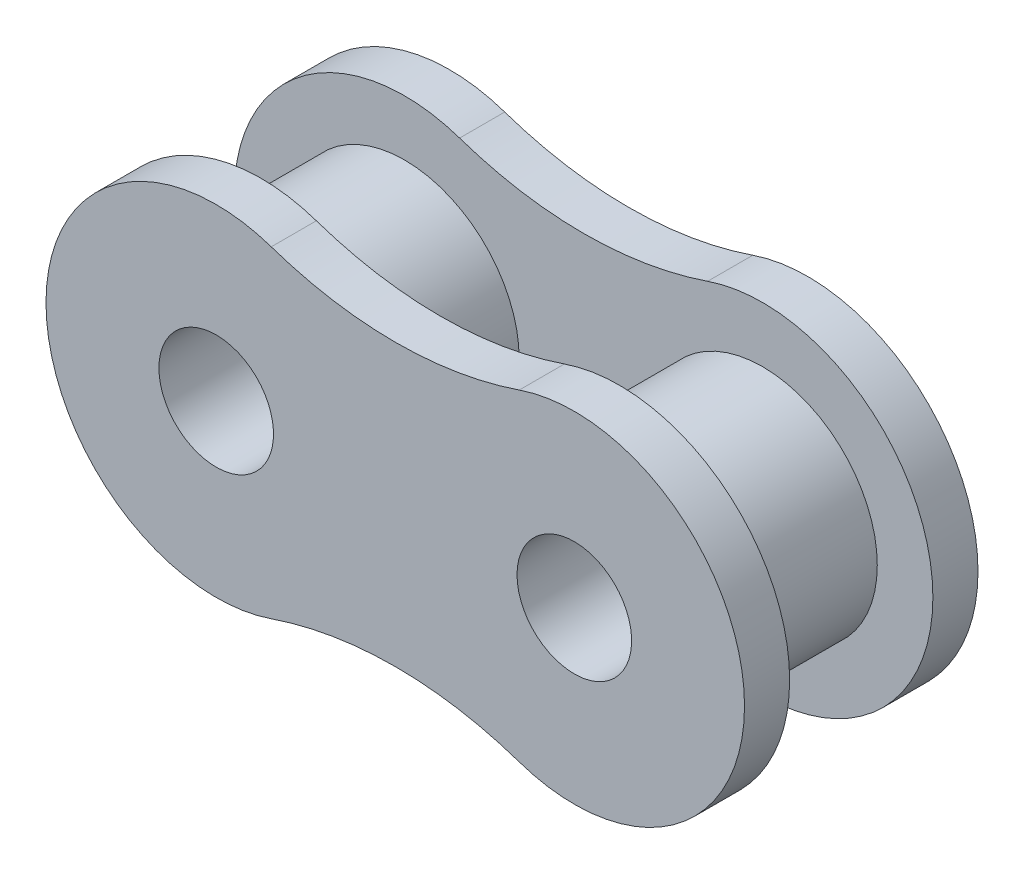
ISO-10303-21;
HEADER;
FILE_DESCRIPTION(('STEP AP214'),'2;1');
FILE_NAME('part.step','',(''),(''),'','','');
FILE_SCHEMA(('AUTOMOTIVE_DESIGN { 1 0 10303 214 1 1 1 1 }'));
ENDSEC;
DATA;
#1=APPLICATION_CONTEXT('core data for automotive mechanical design processes');
#2=APPLICATION_PROTOCOL_DEFINITION('international standard','automotive_design',2000,#1);
#3=PRODUCT_CONTEXT('',#1,'mechanical');
#4=PRODUCT('Part','Part','',(#3));
#5=PRODUCT_RELATED_PRODUCT_CATEGORY('part','',(#4));
#6=PRODUCT_DEFINITION_FORMATION('','',#4);
#7=PRODUCT_DEFINITION_CONTEXT('part definition',#1,'design');
#8=PRODUCT_DEFINITION('design','',#6,#7);
#9=PRODUCT_DEFINITION_SHAPE('','',#8);
#10=(LENGTH_UNIT() NAMED_UNIT(*) SI_UNIT(.MILLI.,.METRE.));
#11=(NAMED_UNIT(*) PLANE_ANGLE_UNIT() SI_UNIT($,.RADIAN.));
#12=(NAMED_UNIT(*) SI_UNIT($,.STERADIAN.) SOLID_ANGLE_UNIT());
#13=UNCERTAINTY_MEASURE_WITH_UNIT(LENGTH_MEASURE(1.E-05),#10,'distance_accuracy_value','');
#14=(GEOMETRIC_REPRESENTATION_CONTEXT(3) GLOBAL_UNCERTAINTY_ASSIGNED_CONTEXT((#13)) GLOBAL_UNIT_ASSIGNED_CONTEXT((#10,
#11,#12)) REPRESENTATION_CONTEXT('',''));
#15=CARTESIAN_POINT('',(0.,0.,0.));
#16=DIRECTION('',(0.,0.,1.));
#17=DIRECTION('',(1.,0.,0.));
#18=AXIS2_PLACEMENT_3D('',#15,#16,#17);
#19=CARTESIAN_POINT('',(11.90625,11.6130650427654,2.));
#20=DIRECTION('',(0.,0.,1.));
#21=DIRECTION('',(1.,0.,0.));
#22=AXIS2_PLACEMENT_3D('',#19,#20,#21);
#23=PLANE('',#22);
#24=CARTESIAN_POINT('',(0.,0.,2.));
#25=DIRECTION('',(0.,0.,-1.));
#26=DIRECTION('',(-1.,0.,0.));
#27=AXIS2_PLACEMENT_3D('',#24,#25,#26);
#28=CIRCLE('',#27,5.08);
#29=CARTESIAN_POINT('',(-5.08,0.,2.));
#30=VERTEX_POINT('',#29);
#31=EDGE_CURVE('E91',#30,#30,#28,.F.);
#32=ORIENTED_EDGE('',*,*,#31,.F.);
#33=EDGE_LOOP('',(#32));
#34=FACE_BOUND('',#33,.T.);
#35=CARTESIAN_POINT('',(7.9375,-23.2261300855308,2.));
#36=DIRECTION('',(0.,0.,-1.));
#37=DIRECTION('',(-1.,0.,0.));
#38=AXIS2_PLACEMENT_3D('',#35,#36,#37);
#39=CIRCLE('',#38,17.);
#40=CARTESIAN_POINT('',(2.43994448971277,-7.13958653474557,2.));
#41=VERTEX_POINT('',#40);
#42=CARTESIAN_POINT('',(13.4350555102872,-7.13958653474557,2.));
#43=VERTEX_POINT('',#42);
#44=EDGE_CURVE('E82',#41,#43,#39,.T.);
#45=ORIENTED_EDGE('',*,*,#44,.T.);
#46=CARTESIAN_POINT('',(15.875,0.,2.));
#47=DIRECTION('',(0.,0.,-1.));
#48=DIRECTION('',(-1.,0.,0.));
#49=AXIS2_PLACEMENT_3D('',#46,#47,#48);
#50=CIRCLE('',#49,7.545);
#51=CARTESIAN_POINT('',(13.4350555102872,7.13958653474557,2.));
#52=VERTEX_POINT('',#51);
#53=EDGE_CURVE('E98',#52,#43,#50,.T.);
#54=ORIENTED_EDGE('',*,*,#53,.F.);
#55=CARTESIAN_POINT('',(7.9375,23.2261300855308,2.));
#56=DIRECTION('',(0.,0.,-1.));
#57=DIRECTION('',(-1.,0.,0.));
#58=AXIS2_PLACEMENT_3D('',#55,#56,#57);
#59=CIRCLE('',#58,17.);
#60=CARTESIAN_POINT('',(2.43994448971277,7.13958653474557,2.));
#61=VERTEX_POINT('',#60);
#62=EDGE_CURVE('E85',#52,#61,#59,.T.);
#63=ORIENTED_EDGE('',*,*,#62,.T.);
#64=CARTESIAN_POINT('',(0.,0.,2.));
#65=DIRECTION('',(0.,0.,-1.));
#66=DIRECTION('',(-1.,0.,0.));
#67=AXIS2_PLACEMENT_3D('',#64,#65,#66);
#68=CIRCLE('',#67,7.545);
#69=EDGE_CURVE('E79',#41,#61,#68,.T.);
#70=ORIENTED_EDGE('',*,*,#69,.F.);
#71=EDGE_LOOP('',(#45,#54,#63,#70));
#72=FACE_BOUND('',#71,.T.);
#73=CARTESIAN_POINT('',(15.875,0.,2.));
#74=DIRECTION('',(0.,0.,-1.));
#75=DIRECTION('',(-1.,0.,0.));
#76=AXIS2_PLACEMENT_3D('',#73,#74,#75);
#77=CIRCLE('',#76,5.08);
#78=CARTESIAN_POINT('',(10.795,0.,2.));
#79=VERTEX_POINT('',#78);
#80=EDGE_CURVE('E19',#79,#79,#77,.F.);
#81=ORIENTED_EDGE('',*,*,#80,.F.);
#82=EDGE_LOOP('',(#81));
#83=FACE_BOUND('',#82,.T.);
#84=ADVANCED_FACE('F16',(#34,#72,#83),#23,.T.);
#85=CARTESIAN_POINT('',(15.875,0.,5.175));
#86=DIRECTION('',(0.,0.,-1.));
#87=DIRECTION('',(-1.,0.,0.));
#88=AXIS2_PLACEMENT_3D('',#85,#86,#87);
#89=CYLINDRICAL_SURFACE('',#88,5.08);
#90=ORIENTED_EDGE('',*,*,#80,.T.);
#91=EDGE_LOOP('',(#90));
#92=FACE_BOUND('',#91,.T.);
#93=CARTESIAN_POINT('',(15.875,0.,8.35));
#94=DIRECTION('',(0.,0.,-1.));
#95=DIRECTION('',(-1.,0.,0.));
#96=AXIS2_PLACEMENT_3D('',#93,#94,#95);
#97=CIRCLE('',#96,5.08);
#98=CARTESIAN_POINT('',(10.795,0.,8.35));
#99=VERTEX_POINT('',#98);
#100=EDGE_CURVE('E151',#99,#99,#97,.F.);
#101=ORIENTED_EDGE('',*,*,#100,.F.);
#102=EDGE_LOOP('',(#101));
#103=FACE_BOUND('',#102,.T.);
#104=ADVANCED_FACE('F163',(#92,#103),#89,.T.);
#105=CARTESIAN_POINT('',(0.,0.,5.175));
#106=DIRECTION('',(0.,0.,-1.));
#107=DIRECTION('',(-1.,0.,0.));
#108=AXIS2_PLACEMENT_3D('',#105,#106,#107);
#109=CYLINDRICAL_SURFACE('',#108,5.08);
#110=ORIENTED_EDGE('',*,*,#31,.T.);
#111=EDGE_LOOP('',(#110));
#112=FACE_BOUND('',#111,.T.);
#113=CARTESIAN_POINT('',(0.,0.,8.35));
#114=DIRECTION('',(0.,0.,-1.));
#115=DIRECTION('',(-1.,0.,0.));
#116=AXIS2_PLACEMENT_3D('',#113,#114,#115);
#117=CIRCLE('',#116,5.08);
#118=CARTESIAN_POINT('',(-5.08,0.,8.35));
#119=VERTEX_POINT('',#118);
#120=EDGE_CURVE('E148',#119,#119,#117,.F.);
#121=ORIENTED_EDGE('',*,*,#120,.F.);
#122=EDGE_LOOP('',(#121));
#123=FACE_BOUND('',#122,.T.);
#124=ADVANCED_FACE('F171',(#112,#123),#109,.T.);
#125=CARTESIAN_POINT('',(0.,0.,2.));
#126=DIRECTION('',(0.,0.,-1.));
#127=DIRECTION('',(-1.,0.,0.));
#128=AXIS2_PLACEMENT_3D('',#125,#126,#127);
#129=CYLINDRICAL_SURFACE('',#128,7.545);
#130=CARTESIAN_POINT('',(0.,0.,0.));
#131=DIRECTION('',(0.,0.,-1.));
#132=DIRECTION('',(-1.,0.,0.));
#133=AXIS2_PLACEMENT_3D('',#130,#131,#132);
#134=CIRCLE('',#133,7.545);
#135=CARTESIAN_POINT('',(2.43994448971277,7.13958653474557,0.));
#136=VERTEX_POINT('',#135);
#137=CARTESIAN_POINT('',(2.43994448971277,-7.13958653474557,0.));
#138=VERTEX_POINT('',#137);
#139=EDGE_CURVE('E102',#136,#138,#134,.F.);
#140=ORIENTED_EDGE('',*,*,#139,.T.);
#141=DIRECTION('',(0.,0.,-1.));
#142=VECTOR('',#141,1.);
#143=CARTESIAN_POINT('',(2.43994448971277,-7.13958653474557,2.));
#144=LINE('',#143,#142);
#145=EDGE_CURVE('E90',#138,#41,#144,.F.);
#146=ORIENTED_EDGE('',*,*,#145,.T.);
#147=ORIENTED_EDGE('',*,*,#69,.T.);
#148=DIRECTION('',(0.,0.,-1.));
#149=VECTOR('',#148,1.);
#150=CARTESIAN_POINT('',(2.43994448971277,7.13958653474557,2.));
#151=LINE('',#150,#149);
#152=EDGE_CURVE('E154',#61,#136,#151,.T.);
#153=ORIENTED_EDGE('',*,*,#152,.T.);
#154=EDGE_LOOP('',(#140,#146,#147,#153));
#155=FACE_BOUND('',#154,.T.);
#156=ADVANCED_FACE('F101',(#155),#129,.T.);
#157=CARTESIAN_POINT('',(7.9375,-23.2261300855308,2.));
#158=DIRECTION('',(0.,0.,-1.));
#159=DIRECTION('',(-1.,0.,0.));
#160=AXIS2_PLACEMENT_3D('',#157,#158,#159);
#161=CYLINDRICAL_SURFACE('',#160,17.);
#162=DIRECTION('',(0.,0.,-1.));
#163=VECTOR('',#162,1.);
#164=CARTESIAN_POINT('',(13.4350555102872,-7.13958653474557,2.));
#165=LINE('',#164,#163);
#166=CARTESIAN_POINT('',(13.4350555102872,-7.13958653474557,0.));
#167=VERTEX_POINT('',#166);
#168=EDGE_CURVE('E97',#43,#167,#165,.T.);
#169=ORIENTED_EDGE('',*,*,#168,.F.);
#170=ORIENTED_EDGE('',*,*,#44,.F.);
#171=ORIENTED_EDGE('',*,*,#145,.F.);
#172=CARTESIAN_POINT('',(7.9375,-23.2261300855308,0.));
#173=DIRECTION('',(0.,0.,-1.));
#174=DIRECTION('',(-1.,0.,0.));
#175=AXIS2_PLACEMENT_3D('',#172,#173,#174);
#176=CIRCLE('',#175,17.);
#177=EDGE_CURVE('E145',#138,#167,#176,.T.);
#178=ORIENTED_EDGE('',*,*,#177,.T.);
#179=EDGE_LOOP('',(#169,#170,#171,#178));
#180=FACE_BOUND('',#179,.T.);
#181=ADVANCED_FACE('F94',(#180),#161,.F.);
#182=CARTESIAN_POINT('',(15.875,0.,2.));
#183=DIRECTION('',(0.,0.,-1.));
#184=DIRECTION('',(-1.,0.,0.));
#185=AXIS2_PLACEMENT_3D('',#182,#183,#184);
#186=CYLINDRICAL_SURFACE('',#185,7.545);
#187=ORIENTED_EDGE('',*,*,#53,.T.);
#188=ORIENTED_EDGE('',*,*,#168,.T.);
#189=CARTESIAN_POINT('',(15.875,0.,0.));
#190=DIRECTION('',(0.,0.,-1.));
#191=DIRECTION('',(-1.,0.,0.));
#192=AXIS2_PLACEMENT_3D('',#189,#190,#191);
#193=CIRCLE('',#192,7.545);
#194=CARTESIAN_POINT('',(13.4350555102872,7.13958653474557,0.));
#195=VERTEX_POINT('',#194);
#196=EDGE_CURVE('E142',#167,#195,#193,.F.);
#197=ORIENTED_EDGE('',*,*,#196,.T.);
#198=DIRECTION('',(0.,0.,-1.));
#199=VECTOR('',#198,1.);
#200=CARTESIAN_POINT('',(13.4350555102872,7.13958653474557,2.));
#201=LINE('',#200,#199);
#202=EDGE_CURVE('E156',#195,#52,#201,.F.);
#203=ORIENTED_EDGE('',*,*,#202,.T.);
#204=EDGE_LOOP('',(#187,#188,#197,#203));
#205=FACE_BOUND('',#204,.T.);
#206=ADVANCED_FACE('F215',(#205),#186,.T.);
#207=CARTESIAN_POINT('',(7.9375,23.2261300855308,2.));
#208=DIRECTION('',(0.,0.,-1.));
#209=DIRECTION('',(-1.,0.,0.));
#210=AXIS2_PLACEMENT_3D('',#207,#208,#209);
#211=CYLINDRICAL_SURFACE('',#210,17.);
#212=ORIENTED_EDGE('',*,*,#152,.F.);
#213=ORIENTED_EDGE('',*,*,#62,.F.);
#214=ORIENTED_EDGE('',*,*,#202,.F.);
#215=CARTESIAN_POINT('',(7.9375,23.2261300855308,0.));
#216=DIRECTION('',(0.,0.,-1.));
#217=DIRECTION('',(-1.,0.,0.));
#218=AXIS2_PLACEMENT_3D('',#215,#216,#217);
#219=CIRCLE('',#218,17.);
#220=EDGE_CURVE('E139',#195,#136,#219,.T.);
#221=ORIENTED_EDGE('',*,*,#220,.T.);
#222=EDGE_LOOP('',(#212,#213,#214,#221));
#223=FACE_BOUND('',#222,.T.);
#224=ADVANCED_FACE('F211',(#223),#211,.F.);
#225=CARTESIAN_POINT('',(11.90625,11.6130650427654,8.35));
#226=DIRECTION('',(0.,0.,-1.));
#227=DIRECTION('',(-1.,0.,0.));
#228=AXIS2_PLACEMENT_3D('',#225,#226,#227);
#229=PLANE('',#228);
#230=ORIENTED_EDGE('',*,*,#120,.T.);
#231=EDGE_LOOP('',(#230));
#232=FACE_BOUND('',#231,.T.);
#233=CARTESIAN_POINT('',(7.9375,-23.2261300855308,8.35));
#234=DIRECTION('',(0.,0.,1.));
#235=DIRECTION('',(1.,0.,0.));
#236=AXIS2_PLACEMENT_3D('',#233,#234,#235);
#237=CIRCLE('',#236,17.);
#238=CARTESIAN_POINT('',(13.4350555102872,-7.13958653474557,8.35));
#239=VERTEX_POINT('',#238);
#240=CARTESIAN_POINT('',(2.43994448971277,-7.13958653474557,8.35));
#241=VERTEX_POINT('',#240);
#242=EDGE_CURVE('E133',#239,#241,#237,.T.);
#243=ORIENTED_EDGE('',*,*,#242,.T.);
#244=CARTESIAN_POINT('',(0.,0.,8.35));
#245=DIRECTION('',(0.,0.,1.));
#246=DIRECTION('',(1.,0.,0.));
#247=AXIS2_PLACEMENT_3D('',#244,#245,#246);
#248=CIRCLE('',#247,7.545);
#249=CARTESIAN_POINT('',(2.43994448971277,7.13958653474557,8.35));
#250=VERTEX_POINT('',#249);
#251=EDGE_CURVE('E130',#250,#241,#248,.T.);
#252=ORIENTED_EDGE('',*,*,#251,.F.);
#253=CARTESIAN_POINT('',(7.9375,23.2261300855308,8.35));
#254=DIRECTION('',(0.,0.,1.));
#255=DIRECTION('',(1.,0.,0.));
#256=AXIS2_PLACEMENT_3D('',#253,#254,#255);
#257=CIRCLE('',#256,17.);
#258=CARTESIAN_POINT('',(13.4350555102872,7.13958653474557,8.35));
#259=VERTEX_POINT('',#258);
#260=EDGE_CURVE('E126',#250,#259,#257,.T.);
#261=ORIENTED_EDGE('',*,*,#260,.T.);
#262=CARTESIAN_POINT('',(15.875,0.,8.35));
#263=DIRECTION('',(0.,0.,1.));
#264=DIRECTION('',(1.,0.,0.));
#265=AXIS2_PLACEMENT_3D('',#262,#263,#264);
#266=CIRCLE('',#265,7.545);
#267=EDGE_CURVE('E137',#239,#259,#266,.T.);
#268=ORIENTED_EDGE('',*,*,#267,.F.);
#269=EDGE_LOOP('',(#243,#252,#261,#268));
#270=FACE_BOUND('',#269,.T.);
#271=ORIENTED_EDGE('',*,*,#100,.T.);
#272=EDGE_LOOP('',(#271));
#273=FACE_BOUND('',#272,.T.);
#274=ADVANCED_FACE('F207',(#232,#270,#273),#229,.T.);
#275=CARTESIAN_POINT('',(11.90625,11.6130650427654,0.));
#276=DIRECTION('',(0.,0.,1.));
#277=DIRECTION('',(1.,0.,0.));
#278=AXIS2_PLACEMENT_3D('',#275,#276,#277);
#279=PLANE('',#278);
#280=CARTESIAN_POINT('',(15.875,0.,0.));
#281=DIRECTION('',(0.,0.,-1.));
#282=DIRECTION('',(-1.,0.,0.));
#283=AXIS2_PLACEMENT_3D('',#280,#281,#282);
#284=CIRCLE('',#283,2.54);
#285=CARTESIAN_POINT('',(13.335,0.,0.));
#286=VERTEX_POINT('',#285);
#287=EDGE_CURVE('E119',#286,#286,#284,.F.);
#288=ORIENTED_EDGE('',*,*,#287,.T.);
#289=EDGE_LOOP('',(#288));
#290=FACE_BOUND('',#289,.T.);
#291=CARTESIAN_POINT('',(0.,0.,0.));
#292=DIRECTION('',(0.,0.,-1.));
#293=DIRECTION('',(-1.,0.,0.));
#294=AXIS2_PLACEMENT_3D('',#291,#292,#293);
#295=CIRCLE('',#294,2.54);
#296=CARTESIAN_POINT('',(-2.54,0.,0.));
#297=VERTEX_POINT('',#296);
#298=EDGE_CURVE('E122',#297,#297,#295,.F.);
#299=ORIENTED_EDGE('',*,*,#298,.T.);
#300=EDGE_LOOP('',(#299));
#301=FACE_BOUND('',#300,.T.);
#302=ORIENTED_EDGE('',*,*,#196,.F.);
#303=ORIENTED_EDGE('',*,*,#177,.F.);
#304=ORIENTED_EDGE('',*,*,#139,.F.);
#305=ORIENTED_EDGE('',*,*,#220,.F.);
#306=EDGE_LOOP('',(#302,#303,#304,#305));
#307=FACE_BOUND('',#306,.T.);
#308=ADVANCED_FACE('F203',(#290,#301,#307),#279,.F.);
#309=CARTESIAN_POINT('',(15.875,0.,8.35));
#310=DIRECTION('',(0.,0.,1.));
#311=DIRECTION('',(1.,0.,0.));
#312=AXIS2_PLACEMENT_3D('',#309,#310,#311);
#313=CYLINDRICAL_SURFACE('',#312,7.545);
#314=ORIENTED_EDGE('',*,*,#267,.T.);
#315=DIRECTION('',(0.,0.,1.));
#316=VECTOR('',#315,1.);
#317=CARTESIAN_POINT('',(13.4350555102872,7.13958653474557,8.35));
#318=LINE('',#317,#316);
#319=CARTESIAN_POINT('',(13.4350555102872,7.13958653474557,10.35));
#320=VERTEX_POINT('',#319);
#321=EDGE_CURVE('E125',#259,#320,#318,.T.);
#322=ORIENTED_EDGE('',*,*,#321,.T.);
#323=CARTESIAN_POINT('',(15.875,0.,10.35));
#324=DIRECTION('',(0.,0.,1.));
#325=DIRECTION('',(1.,0.,0.));
#326=AXIS2_PLACEMENT_3D('',#323,#324,#325);
#327=CIRCLE('',#326,7.545);
#328=CARTESIAN_POINT('',(13.4350555102872,-7.13958653474557,10.35));
#329=VERTEX_POINT('',#328);
#330=EDGE_CURVE('E116',#320,#329,#327,.F.);
#331=ORIENTED_EDGE('',*,*,#330,.T.);
#332=DIRECTION('',(0.,0.,1.));
#333=VECTOR('',#332,1.);
#334=CARTESIAN_POINT('',(13.4350555102872,-7.13958653474557,8.35));
#335=LINE('',#334,#333);
#336=EDGE_CURVE('E136',#329,#239,#335,.F.);
#337=ORIENTED_EDGE('',*,*,#336,.T.);
#338=EDGE_LOOP('',(#314,#322,#331,#337));
#339=FACE_BOUND('',#338,.T.);
#340=ADVANCED_FACE('F199',(#339),#313,.T.);
#341=CARTESIAN_POINT('',(7.9375,-23.2261300855308,8.35));
#342=DIRECTION('',(0.,0.,1.));
#343=DIRECTION('',(1.,0.,0.));
#344=AXIS2_PLACEMENT_3D('',#341,#342,#343);
#345=CYLINDRICAL_SURFACE('',#344,17.);
#346=DIRECTION('',(0.,0.,1.));
#347=VECTOR('',#346,1.);
#348=CARTESIAN_POINT('',(2.43994448971277,-7.13958653474557,8.35));
#349=LINE('',#348,#347);
#350=CARTESIAN_POINT('',(2.43994448971277,-7.13958653474557,10.35));
#351=VERTEX_POINT('',#350);
#352=EDGE_CURVE('E132',#241,#351,#349,.T.);
#353=ORIENTED_EDGE('',*,*,#352,.F.);
#354=ORIENTED_EDGE('',*,*,#242,.F.);
#355=ORIENTED_EDGE('',*,*,#336,.F.);
#356=CARTESIAN_POINT('',(7.9375,-23.2261300855308,10.35));
#357=DIRECTION('',(0.,0.,1.));
#358=DIRECTION('',(1.,0.,0.));
#359=AXIS2_PLACEMENT_3D('',#356,#357,#358);
#360=CIRCLE('',#359,17.);
#361=EDGE_CURVE('E113',#329,#351,#360,.T.);
#362=ORIENTED_EDGE('',*,*,#361,.T.);
#363=EDGE_LOOP('',(#353,#354,#355,#362));
#364=FACE_BOUND('',#363,.T.);
#365=ADVANCED_FACE('F196',(#364),#345,.F.);
#366=CARTESIAN_POINT('',(0.,0.,8.35));
#367=DIRECTION('',(0.,0.,1.));
#368=DIRECTION('',(1.,0.,0.));
#369=AXIS2_PLACEMENT_3D('',#366,#367,#368);
#370=CYLINDRICAL_SURFACE('',#369,7.545);
#371=CARTESIAN_POINT('',(0.,0.,10.35));
#372=DIRECTION('',(0.,0.,1.));
#373=DIRECTION('',(1.,0.,0.));
#374=AXIS2_PLACEMENT_3D('',#371,#372,#373);
#375=CIRCLE('',#374,7.545);
#376=CARTESIAN_POINT('',(2.43994448971277,7.13958653474557,10.35));
#377=VERTEX_POINT('',#376);
#378=EDGE_CURVE('E34',#351,#377,#375,.F.);
#379=ORIENTED_EDGE('',*,*,#378,.T.);
#380=DIRECTION('',(0.,0.,1.));
#381=VECTOR('',#380,1.);
#382=CARTESIAN_POINT('',(2.43994448971277,7.13958653474557,8.35));
#383=LINE('',#382,#381);
#384=EDGE_CURVE('E129',#377,#250,#383,.F.);
#385=ORIENTED_EDGE('',*,*,#384,.T.);
#386=ORIENTED_EDGE('',*,*,#251,.T.);
#387=ORIENTED_EDGE('',*,*,#352,.T.);
#388=EDGE_LOOP('',(#379,#385,#386,#387));
#389=FACE_BOUND('',#388,.T.);
#390=ADVANCED_FACE('F192',(#389),#370,.T.);
#391=CARTESIAN_POINT('',(7.9375,23.2261300855308,8.35));
#392=DIRECTION('',(0.,0.,1.));
#393=DIRECTION('',(1.,0.,0.));
#394=AXIS2_PLACEMENT_3D('',#391,#392,#393);
#395=CYLINDRICAL_SURFACE('',#394,17.);
#396=ORIENTED_EDGE('',*,*,#321,.F.);
#397=ORIENTED_EDGE('',*,*,#260,.F.);
#398=ORIENTED_EDGE('',*,*,#384,.F.);
#399=CARTESIAN_POINT('',(7.9375,23.2261300855308,10.35));
#400=DIRECTION('',(0.,0.,1.));
#401=DIRECTION('',(1.,0.,0.));
#402=AXIS2_PLACEMENT_3D('',#399,#400,#401);
#403=CIRCLE('',#402,17.);
#404=EDGE_CURVE('E109',#377,#320,#403,.T.);
#405=ORIENTED_EDGE('',*,*,#404,.T.);
#406=EDGE_LOOP('',(#396,#397,#398,#405));
#407=FACE_BOUND('',#406,.T.);
#408=ADVANCED_FACE('F188',(#407),#395,.F.);
#409=CARTESIAN_POINT('',(0.,0.,2.));
#410=DIRECTION('',(0.,0.,-1.));
#411=DIRECTION('',(-1.,0.,0.));
#412=AXIS2_PLACEMENT_3D('',#409,#410,#411);
#413=CYLINDRICAL_SURFACE('',#412,2.54);
#414=ORIENTED_EDGE('',*,*,#298,.F.);
#415=EDGE_LOOP('',(#414));
#416=FACE_BOUND('',#415,.T.);
#417=CARTESIAN_POINT('',(0.,0.,10.35));
#418=DIRECTION('',(0.,0.,-1.));
#419=DIRECTION('',(-1.,0.,0.));
#420=AXIS2_PLACEMENT_3D('',#417,#418,#419);
#421=CIRCLE('',#420,2.54);
#422=CARTESIAN_POINT('',(-2.54,0.,10.35));
#423=VERTEX_POINT('',#422);
#424=EDGE_CURVE('E25',#423,#423,#421,.F.);
#425=ORIENTED_EDGE('',*,*,#424,.T.);
#426=EDGE_LOOP('',(#425));
#427=FACE_BOUND('',#426,.T.);
#428=ADVANCED_FACE('F180',(#416,#427),#413,.F.);
#429=CARTESIAN_POINT('',(15.875,0.,2.));
#430=DIRECTION('',(0.,0.,-1.));
#431=DIRECTION('',(-1.,0.,0.));
#432=AXIS2_PLACEMENT_3D('',#429,#430,#431);
#433=CYLINDRICAL_SURFACE('',#432,2.54);
#434=ORIENTED_EDGE('',*,*,#287,.F.);
#435=EDGE_LOOP('',(#434));
#436=FACE_BOUND('',#435,.T.);
#437=CARTESIAN_POINT('',(15.875,0.,10.35));
#438=DIRECTION('',(0.,0.,-1.));
#439=DIRECTION('',(-1.,0.,0.));
#440=AXIS2_PLACEMENT_3D('',#437,#438,#439);
#441=CIRCLE('',#440,2.54);
#442=CARTESIAN_POINT('',(13.335,0.,10.35));
#443=VERTEX_POINT('',#442);
#444=EDGE_CURVE('E11',#443,#443,#441,.F.);
#445=ORIENTED_EDGE('',*,*,#444,.T.);
#446=EDGE_LOOP('',(#445));
#447=FACE_BOUND('',#446,.T.);
#448=ADVANCED_FACE('F174',(#436,#447),#433,.F.);
#449=CARTESIAN_POINT('',(11.90625,11.6130650427654,10.35));
#450=DIRECTION('',(0.,0.,-1.));
#451=DIRECTION('',(-1.,0.,0.));
#452=AXIS2_PLACEMENT_3D('',#449,#450,#451);
#453=PLANE('',#452);
#454=ORIENTED_EDGE('',*,*,#444,.F.);
#455=EDGE_LOOP('',(#454));
#456=FACE_BOUND('',#455,.T.);
#457=ORIENTED_EDGE('',*,*,#424,.F.);
#458=EDGE_LOOP('',(#457));
#459=FACE_BOUND('',#458,.T.);
#460=ORIENTED_EDGE('',*,*,#404,.F.);
#461=ORIENTED_EDGE('',*,*,#378,.F.);
#462=ORIENTED_EDGE('',*,*,#361,.F.);
#463=ORIENTED_EDGE('',*,*,#330,.F.);
#464=EDGE_LOOP('',(#460,#461,#462,#463));
#465=FACE_BOUND('',#464,.T.);
#466=ADVANCED_FACE('F172',(#456,#459,#465),#453,.F.);
#467=CLOSED_SHELL('',(#84,#104,#124,#156,#181,#206,#224,#274,#308,#340,#365,#390,#408,#428,#448,#466));
#468=MANIFOLD_SOLID_BREP('B1',#467);
#469=ADVANCED_BREP_SHAPE_REPRESENTATION('',(#18,#468),#14);
#470=SHAPE_DEFINITION_REPRESENTATION(#9,#469);
ENDSEC;
END-ISO-10303-21;
